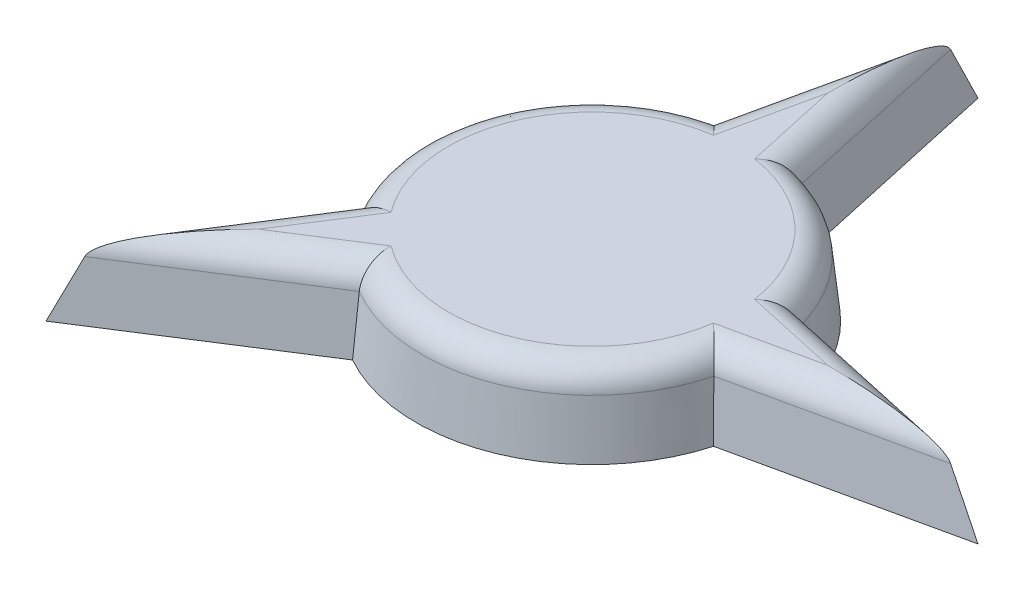
ISO-10303-21;
HEADER;
FILE_DESCRIPTION(('STEP AP214'),'2;1');
FILE_NAME('part.step','',(''),(''),'','','');
FILE_SCHEMA(('AUTOMOTIVE_DESIGN { 1 0 10303 214 1 1 1 1 }'));
ENDSEC;
DATA;
#1=APPLICATION_CONTEXT('core data for automotive mechanical design processes');
#2=APPLICATION_PROTOCOL_DEFINITION('international standard','automotive_design',2000,#1);
#3=PRODUCT_CONTEXT('',#1,'mechanical');
#4=PRODUCT('Part','Part','',(#3));
#5=PRODUCT_RELATED_PRODUCT_CATEGORY('part','',(#4));
#6=PRODUCT_DEFINITION_FORMATION('','',#4);
#7=PRODUCT_DEFINITION_CONTEXT('part definition',#1,'design');
#8=PRODUCT_DEFINITION('design','',#6,#7);
#9=PRODUCT_DEFINITION_SHAPE('','',#8);
#10=(LENGTH_UNIT() NAMED_UNIT(*) SI_UNIT(.MILLI.,.METRE.));
#11=(NAMED_UNIT(*) PLANE_ANGLE_UNIT() SI_UNIT($,.RADIAN.));
#12=(NAMED_UNIT(*) SI_UNIT($,.STERADIAN.) SOLID_ANGLE_UNIT());
#13=UNCERTAINTY_MEASURE_WITH_UNIT(LENGTH_MEASURE(1.E-05),#10,'distance_accuracy_value','');
#14=(GEOMETRIC_REPRESENTATION_CONTEXT(3) GLOBAL_UNCERTAINTY_ASSIGNED_CONTEXT((#13)) GLOBAL_UNIT_ASSIGNED_CONTEXT((#10,
#11,#12)) REPRESENTATION_CONTEXT('',''));
#15=CARTESIAN_POINT('',(0.,0.,0.));
#16=DIRECTION('',(0.,0.,1.));
#17=DIRECTION('',(1.,0.,0.));
#18=AXIS2_PLACEMENT_3D('',#15,#16,#17);
#19=CARTESIAN_POINT('',(0.,0.,0.));
#20=DIRECTION('',(0.,-1.,0.));
#21=DIRECTION('',(0.,0.,1.));
#22=AXIS2_PLACEMENT_3D('',#19,#20,#21);
#23=CONICAL_SURFACE('',#22,6.62463400876314,0.10471975511966);
#24=CARTESIAN_POINT('',(6.12143648206492,3.,1.52825086294976));
#25=CARTESIAN_POINT('',(6.16452146315479,2.50003379183349,1.57258412459455));
#26=CARTESIAN_POINT('',(6.20734635404647,2.00005068603496,1.61697636934305));
#27=CARTESIAN_POINT('',(6.29247595484941,1.0000506860345,1.70587882443751));
#28=CARTESIAN_POINT('',(6.33478066476781,0.500033791833026,1.75038903478186));
#29=CARTESIAN_POINT('',(6.37682528449516,0.,1.79495822822829));
#30=B_SPLINE_CURVE_WITH_KNOTS('',3,(#24,#25,#26,#27,#28,#29),.UNSPECIFIED.,.F.,.F.,(4,2,4),(0.,
1.51132052815368,3.02264103557015),.UNSPECIFIED.);
#31=CARTESIAN_POINT('',(6.19832923183421,2.10452846326765,1.60771506593604));
#32=VERTEX_POINT('',#31);
#33=CARTESIAN_POINT('',(6.37682528449516,0.,1.79495822822829));
#34=VERTEX_POINT('',#33);
#35=EDGE_CURVE('E137',#32,#34,#30,.T.);
#36=ORIENTED_EDGE('',*,*,#35,.F.);
#37=CARTESIAN_POINT('',(0.,2.10452846326765,0.));
#38=DIRECTION('',(0.,-1.,0.));
#39=DIRECTION('',(0.,0.,-1.));
#40=AXIS2_PLACEMENT_3D('',#37,#38,#39);
#41=CIRCLE('',#40,6.40343915403654);
#42=CARTESIAN_POINT('',(-3.24605440651769,2.10452846326765,5.51970685719589));
#43=VERTEX_POINT('',#42);
#44=EDGE_CURVE('E11',#32,#43,#41,.T.);
#45=ORIENTED_EDGE('',*,*,#44,.T.);
#46=CARTESIAN_POINT('',(-3.24787269852493,3.,5.40914579561675));
#47=CARTESIAN_POINT('',(-3.24699003087971,2.50003379183349,5.47095982785385));
#48=CARTESIAN_POINT('',(-3.24588174433904,2.00005068603496,5.53263165590068));
#49=CARTESIAN_POINT('',(-3.24321393348508,1.0000506860345,5.65569090276957));
#50=CARTESIAN_POINT('',(-3.24165440917798,0.500033791833026,5.71707832159553));
#51=CARTESIAN_POINT('',(-3.23986926598162,0.,5.77832353623513));
#52=B_SPLINE_CURVE_WITH_KNOTS('',3,(#46,#47,#48,#49,#50,#51),.UNSPECIFIED.,.F.,.F.,(4,2,4),(0.,
1.51132052815368,3.02264103557016),.UNSPECIFIED.);
#53=CARTESIAN_POINT('',(-3.23986926598162,0.,5.77832353623513));
#54=VERTEX_POINT('',#53);
#55=EDGE_CURVE('E150',#43,#54,#52,.T.);
#56=ORIENTED_EDGE('',*,*,#55,.T.);
#57=CARTESIAN_POINT('',(0.,0.,0.));
#58=DIRECTION('',(0.,1.,0.));
#59=DIRECTION('',(0.,0.,1.));
#60=AXIS2_PLACEMENT_3D('',#57,#58,#59);
#61=CIRCLE('',#60,6.62463400876314);
#62=EDGE_CURVE('E148',#54,#34,#61,.T.);
#63=ORIENTED_EDGE('',*,*,#62,.T.);
#64=EDGE_LOOP('',(#36,#45,#56,#63));
#65=FACE_BOUND('',#64,.T.);
#66=ADVANCED_FACE('F35',(#65),#23,.T.);
#67=CARTESIAN_POINT('',(0.670179790785248,0.,3.04921033416259));
#68=DIRECTION('',(0.213488310774602,0.104528463267654,0.971337501350334));
#69=DIRECTION('',(0.976687899858299,0.,-0.214664264073891));
#70=AXIS2_PLACEMENT_3D('',#67,#68,#69);
#71=PLANE('',#70);
#72=DIRECTION('',(-0.43974109158402,0.898124586219804,0.));
#73=VECTOR('',#72,1.);
#74=CARTESIAN_POINT('',(11.8608631918567,5.47919899962963,0.));
#75=LINE('',#74,#73);
#76=CARTESIAN_POINT('',(13.513174383606,2.10452846326765,0.));
#77=VERTEX_POINT('',#76);
#78=CARTESIAN_POINT('',(14.5435967302452,0.,0.));
#79=VERTEX_POINT('',#78);
#80=EDGE_CURVE('E145',#77,#79,#75,.F.);
#81=ORIENTED_EDGE('',*,*,#80,.F.);
#82=DIRECTION('',(-0.976687899858299,0.,0.214664264073891));
#83=VECTOR('',#82,1.);
#84=CARTESIAN_POINT('',(0.622697160078432,2.10452846326765,2.83317199604021));
#85=LINE('',#84,#83);
#86=EDGE_CURVE('E49',#77,#32,#85,.T.);
#87=ORIENTED_EDGE('',*,*,#86,.T.);
#88=ORIENTED_EDGE('',*,*,#35,.T.);
#89=DIRECTION('',(-0.976687899858299,0.,0.214664264073891));
#90=VECTOR('',#89,1.);
#91=CARTESIAN_POINT('',(0.670179790785248,0.,3.04921033416259));
#92=LINE('',#91,#90);
#93=EDGE_CURVE('E141',#79,#34,#92,.T.);
#94=ORIENTED_EDGE('',*,*,#93,.F.);
#95=EDGE_LOOP('',(#81,#87,#88,#94));
#96=FACE_BOUND('',#95,.T.);
#97=ADVANCED_FACE('F139',(#96),#71,.T.);
#98=CARTESIAN_POINT('',(0.670179790785269,0.,-3.04921033416259));
#99=DIRECTION('',(0.213488310774609,0.104528463267654,-0.971337501350332));
#100=DIRECTION('',(-0.976687899858298,0.,-0.214664264073898));
#101=AXIS2_PLACEMENT_3D('',#98,#99,#100);
#102=PLANE('',#101);
#103=CARTESIAN_POINT('',(6.12143648206493,3.,-1.52825086294971));
#104=CARTESIAN_POINT('',(6.1645214631548,2.50003379183349,-1.57258412459451));
#105=CARTESIAN_POINT('',(6.20734635404648,2.00005068603496,-1.61697636934301));
#106=CARTESIAN_POINT('',(6.29247595484942,1.0000506860345,-1.70587882443747));
#107=CARTESIAN_POINT('',(6.33478066476782,0.500033791833026,-1.75038903478182));
#108=CARTESIAN_POINT('',(6.37682528449517,0.,-1.79495822822824));
#109=B_SPLINE_CURVE_WITH_KNOTS('',3,(#103,#104,#105,#106,#107,#108),.UNSPECIFIED.,.F.,.F.,(4,2,
4),(0.,1.51132052815368,3.02264103557015),.UNSPECIFIED.);
#110=CARTESIAN_POINT('',(6.19832923183422,2.10452846326765,-1.607715065936));
#111=VERTEX_POINT('',#110);
#112=CARTESIAN_POINT('',(6.37682528449517,0.,-1.79495822822824));
#113=VERTEX_POINT('',#112);
#114=EDGE_CURVE('E237',#111,#113,#109,.T.);
#115=ORIENTED_EDGE('',*,*,#114,.F.);
#116=DIRECTION('',(-0.976687899858298,0.,-0.214664264073898));
#117=VECTOR('',#116,1.);
#118=CARTESIAN_POINT('',(13.0949360212821,2.10452846326765,-0.0919237663011116));
#119=LINE('',#118,#117);
#120=EDGE_CURVE('E64',#111,#77,#119,.F.);
#121=ORIENTED_EDGE('',*,*,#120,.T.);
#122=ORIENTED_EDGE('',*,*,#80,.T.);
#123=DIRECTION('',(-0.976687899858298,0.,-0.214664264073898));
#124=VECTOR('',#123,1.);
#125=CARTESIAN_POINT('',(0.670179790785269,0.,-3.04921033416259));
#126=LINE('',#125,#124);
#127=EDGE_CURVE('E161',#79,#113,#126,.T.);
#128=ORIENTED_EDGE('',*,*,#127,.T.);
#129=EDGE_LOOP('',(#115,#121,#122,#128));
#130=FACE_BOUND('',#129,.T.);
#131=ADVANCED_FACE('F243',(#130),#102,.T.);
#132=CARTESIAN_POINT('',(0.,0.,0.));
#133=DIRECTION('',(0.,-1.,0.));
#134=DIRECTION('',(0.,0.,1.));
#135=AXIS2_PLACEMENT_3D('',#132,#133,#134);
#136=CONICAL_SURFACE('',#135,6.62463400876314,0.10471975511966);
#137=CARTESIAN_POINT('',(1.52825086294973,3.,-6.12143648206492));
#138=CARTESIAN_POINT('',(1.57258412459453,2.50003379183349,-6.16452146315479));
#139=CARTESIAN_POINT('',(1.61697636934303,2.00005068603496,-6.20734635404647));
#140=CARTESIAN_POINT('',(1.70587882443749,1.0000506860345,-6.29247595484942));
#141=CARTESIAN_POINT('',(1.75038903478184,0.500033791833026,-6.33478066476782));
#142=CARTESIAN_POINT('',(1.79495822822827,0.,-6.37682528449516));
#143=B_SPLINE_CURVE_WITH_KNOTS('',3,(#137,#138,#139,#140,#141,#142),.UNSPECIFIED.,.F.,.F.,(4,2,
4),(0.,1.51132052815368,3.02264103557015),.UNSPECIFIED.);
#144=CARTESIAN_POINT('',(1.60771506593602,2.10452846326765,-6.19832923183422));
#145=VERTEX_POINT('',#144);
#146=CARTESIAN_POINT('',(1.79495822822827,0.,-6.37682528449516));
#147=VERTEX_POINT('',#146);
#148=EDGE_CURVE('E232',#145,#147,#143,.T.);
#149=ORIENTED_EDGE('',*,*,#148,.F.);
#150=CARTESIAN_POINT('',(0.,2.10452846326765,0.));
#151=DIRECTION('',(0.,-1.,0.));
#152=DIRECTION('',(0.,0.,-1.));
#153=AXIS2_PLACEMENT_3D('',#150,#151,#152);
#154=CIRCLE('',#153,6.40343915403654);
#155=EDGE_CURVE('E326',#145,#111,#154,.T.);
#156=ORIENTED_EDGE('',*,*,#155,.T.);
#157=ORIENTED_EDGE('',*,*,#114,.T.);
#158=EDGE_CURVE('E156',#113,#147,#61,.T.);
#159=ORIENTED_EDGE('',*,*,#158,.T.);
#160=EDGE_LOOP('',(#149,#156,#157,#159));
#161=FACE_BOUND('',#160,.T.);
#162=ADVANCED_FACE('F228',(#161),#136,.T.);
#163=CARTESIAN_POINT('',(3.04921033416259,0.,-0.670179790785258));
#164=DIRECTION('',(0.971337501350333,0.104528463267654,-0.213488310774605));
#165=DIRECTION('',(-0.214664264073895,0.,-0.976687899858298));
#166=AXIS2_PLACEMENT_3D('',#163,#164,#165);
#167=PLANE('',#166);
#168=DIRECTION('',(0.,0.898124586219804,0.43974109158402));
#169=VECTOR('',#168,1.);
#170=CARTESIAN_POINT('',(0.,5.47919899962963,-11.8608631918567));
#171=LINE('',#170,#169);
#172=CARTESIAN_POINT('',(0.,2.10452846326765,-13.513174383606));
#173=VERTEX_POINT('',#172);
#174=CARTESIAN_POINT('',(0.,0.,-14.5435967302452));
#175=VERTEX_POINT('',#174);
#176=EDGE_CURVE('E217',#173,#175,#171,.F.);
#177=ORIENTED_EDGE('',*,*,#176,.F.);
#178=DIRECTION('',(0.214664264073895,0.,0.976687899858298));
#179=VECTOR('',#178,1.);
#180=CARTESIAN_POINT('',(2.83317199604021,2.10452846326765,-0.622697160078441));
#181=LINE('',#180,#179);
#182=EDGE_CURVE('E356',#173,#145,#181,.T.);
#183=ORIENTED_EDGE('',*,*,#182,.T.);
#184=ORIENTED_EDGE('',*,*,#148,.T.);
#185=DIRECTION('',(0.214664264073895,0.,0.976687899858298));
#186=VECTOR('',#185,1.);
#187=CARTESIAN_POINT('',(3.04921033416259,0.,-0.670179790785258));
#188=LINE('',#187,#186);
#189=EDGE_CURVE('E165',#175,#147,#188,.T.);
#190=ORIENTED_EDGE('',*,*,#189,.F.);
#191=EDGE_LOOP('',(#177,#183,#184,#190));
#192=FACE_BOUND('',#191,.T.);
#193=ADVANCED_FACE('F223',(#192),#167,.T.);
#194=CARTESIAN_POINT('',(-3.04921033416259,0.,-0.670179790785258));
#195=DIRECTION('',(-0.971337501350333,0.104528463267654,-0.213488310774605));
#196=DIRECTION('',(-0.214664264073895,0.,0.976687899858298));
#197=AXIS2_PLACEMENT_3D('',#194,#195,#196);
#198=PLANE('',#197);
#199=CARTESIAN_POINT('',(-1.52825086294973,3.,-6.12143648206492));
#200=CARTESIAN_POINT('',(-1.57258412459453,2.50003379183349,-6.16452146315479));
#201=CARTESIAN_POINT('',(-1.61697636934303,2.00005068603496,-6.20734635404647));
#202=CARTESIAN_POINT('',(-1.70587882443749,1.0000506860345,-6.29247595484942));
#203=CARTESIAN_POINT('',(-1.75038903478184,0.500033791833026,-6.33478066476782));
#204=CARTESIAN_POINT('',(-1.79495822822827,0.,-6.37682528449516));
#205=B_SPLINE_CURVE_WITH_KNOTS('',3,(#199,#200,#201,#202,#203,#204),.UNSPECIFIED.,.F.,.F.,(4,2,
4),(0.,1.51132052815368,3.02264103557015),.UNSPECIFIED.);
#206=CARTESIAN_POINT('',(-1.60771506593602,2.10452846326765,-6.19832923183422));
#207=VERTEX_POINT('',#206);
#208=CARTESIAN_POINT('',(-1.79495822822827,0.,-6.37682528449516));
#209=VERTEX_POINT('',#208);
#210=EDGE_CURVE('E211',#207,#209,#205,.T.);
#211=ORIENTED_EDGE('',*,*,#210,.F.);
#212=DIRECTION('',(-0.214664264073895,0.,0.976687899858298));
#213=VECTOR('',#212,1.);
#214=CARTESIAN_POINT('',(-0.0919237663011577,2.10452846326765,-13.0949360212821));
#215=LINE('',#214,#213);
#216=EDGE_CURVE('E354',#207,#173,#215,.F.);
#217=ORIENTED_EDGE('',*,*,#216,.T.);
#218=ORIENTED_EDGE('',*,*,#176,.T.);
#219=DIRECTION('',(-0.214664264073895,0.,0.976687899858298));
#220=VECTOR('',#219,1.);
#221=CARTESIAN_POINT('',(-3.04921033416259,0.,-0.670179790785258));
#222=LINE('',#221,#220);
#223=EDGE_CURVE('E168',#175,#209,#222,.T.);
#224=ORIENTED_EDGE('',*,*,#223,.T.);
#225=EDGE_LOOP('',(#211,#217,#218,#224));
#226=FACE_BOUND('',#225,.T.);
#227=ADVANCED_FACE('F219',(#226),#198,.T.);
#228=CARTESIAN_POINT('',(0.,0.,0.));
#229=DIRECTION('',(0.,-1.,0.));
#230=DIRECTION('',(0.,0.,1.));
#231=AXIS2_PLACEMENT_3D('',#228,#229,#230);
#232=CONICAL_SURFACE('',#231,6.62463400876314,0.10471975511966);
#233=CARTESIAN_POINT('',(-5.40914579561681,3.,3.24787269852483));
#234=CARTESIAN_POINT('',(-5.47095982785391,2.50003379183349,3.24699003087961));
#235=CARTESIAN_POINT('',(-5.53263165590074,2.00005068603496,3.24588174433894));
#236=CARTESIAN_POINT('',(-5.65569090276963,1.0000506860345,3.24321393348498));
#237=CARTESIAN_POINT('',(-5.71707832159559,0.500033791833026,3.24165440917788));
#238=CARTESIAN_POINT('',(-5.77832353623519,0.,3.23986926598152));
#239=B_SPLINE_CURVE_WITH_KNOTS('',3,(#233,#234,#235,#236,#237,#238),.UNSPECIFIED.,.F.,.F.,(4,2,
4),(0.,1.51132052815368,3.02264103557015),.UNSPECIFIED.);
#240=CARTESIAN_POINT('',(-5.51970685719595,2.10452846326765,3.24605440651759));
#241=VERTEX_POINT('',#240);
#242=CARTESIAN_POINT('',(-5.77832353623519,0.,3.23986926598152));
#243=VERTEX_POINT('',#242);
#244=EDGE_CURVE('E206',#241,#243,#239,.T.);
#245=ORIENTED_EDGE('',*,*,#244,.F.);
#246=CARTESIAN_POINT('',(0.,2.10452846326765,0.));
#247=DIRECTION('',(0.,-1.,0.));
#248=DIRECTION('',(0.,0.,-1.));
#249=AXIS2_PLACEMENT_3D('',#246,#247,#248);
#250=CIRCLE('',#249,6.40343915403654);
#251=EDGE_CURVE('E352',#241,#207,#250,.T.);
#252=ORIENTED_EDGE('',*,*,#251,.T.);
#253=ORIENTED_EDGE('',*,*,#210,.T.);
#254=EDGE_CURVE('E155',#209,#243,#61,.T.);
#255=ORIENTED_EDGE('',*,*,#254,.T.);
#256=EDGE_LOOP('',(#245,#252,#253,#255));
#257=FACE_BOUND('',#256,.T.);
#258=ADVANCED_FACE('F201',(#257),#232,.T.);
#259=CARTESIAN_POINT('',(-2.63000597922889,0.,-1.68222862987205));
#260=DIRECTION('',(-0.837798366278398,0.104528463267654,-0.53588030177284));
#261=DIRECTION('',(-0.538832080287587,0.,0.842413193897717));
#262=AXIS2_PLACEMENT_3D('',#259,#260,#261);
#263=PLANE('',#262);
#264=DIRECTION('',(0.310943907825438,0.898124586219804,-0.310943907825433));
#265=VECTOR('',#264,1.);
#266=CARTESIAN_POINT('',(-8.38689679368786,5.47919899962963,8.38689679368771));
#267=LINE('',#266,#265);
#268=CARTESIAN_POINT('',(-9.55525724200427,2.10452846326765,9.5552572420041));
#269=VERTEX_POINT('',#268);
#270=CARTESIAN_POINT('',(-10.283875870799,0.,10.2838758707988));
#271=VERTEX_POINT('',#270);
#272=EDGE_CURVE('E212',#269,#271,#267,.F.);
#273=ORIENTED_EDGE('',*,*,#272,.F.);
#274=DIRECTION('',(0.538832080287587,0.,-0.842413193897717));
#275=VECTOR('',#274,1.);
#276=CARTESIAN_POINT('',(-2.44366851518492,2.10452846326765,-1.56304174615081));
#277=LINE('',#276,#275);
#278=EDGE_CURVE('E350',#269,#241,#277,.T.);
#279=ORIENTED_EDGE('',*,*,#278,.T.);
#280=ORIENTED_EDGE('',*,*,#244,.T.);
#281=DIRECTION('',(0.538832080287587,0.,-0.842413193897717));
#282=VECTOR('',#281,1.);
#283=CARTESIAN_POINT('',(-2.63000597922889,0.,-1.68222862987205));
#284=LINE('',#283,#282);
#285=EDGE_CURVE('E171',#271,#243,#284,.T.);
#286=ORIENTED_EDGE('',*,*,#285,.F.);
#287=EDGE_LOOP('',(#273,#279,#280,#286));
#288=FACE_BOUND('',#287,.T.);
#289=ADVANCED_FACE('F196',(#288),#263,.T.);
#290=CARTESIAN_POINT('',(1.68222862987201,0.,2.63000597922892));
#291=DIRECTION('',(0.535880301772826,0.104528463267654,0.837798366278407));
#292=DIRECTION('',(0.842413193897726,0.,-0.538832080287572));
#293=AXIS2_PLACEMENT_3D('',#290,#291,#292);
#294=PLANE('',#293);
#295=ORIENTED_EDGE('',*,*,#55,.F.);
#296=DIRECTION('',(0.842413193897726,0.,-0.538832080287572));
#297=VECTOR('',#296,1.);
#298=CARTESIAN_POINT('',(-9.19451814134889,2.10452846326765,9.32451797835624));
#299=LINE('',#298,#297);
#300=EDGE_CURVE('E347',#43,#269,#299,.F.);
#301=ORIENTED_EDGE('',*,*,#300,.T.);
#302=ORIENTED_EDGE('',*,*,#272,.T.);
#303=DIRECTION('',(0.842413193897726,0.,-0.538832080287572));
#304=VECTOR('',#303,1.);
#305=CARTESIAN_POINT('',(1.68222862987201,0.,2.63000597922892));
#306=LINE('',#305,#304);
#307=EDGE_CURVE('E174',#271,#54,#306,.T.);
#308=ORIENTED_EDGE('',*,*,#307,.T.);
#309=EDGE_LOOP('',(#295,#301,#302,#308));
#310=FACE_BOUND('',#309,.T.);
#311=ADVANCED_FACE('F190',(#310),#294,.T.);
#312=CARTESIAN_POINT('',(0.,3.,0.));
#313=DIRECTION('',(0.,1.,0.));
#314=DIRECTION('',(0.,0.,1.));
#315=AXIS2_PLACEMENT_3D('',#312,#313,#314);
#316=PLANE('',#315);
#317=DIRECTION('',(0.538832080287587,0.,-0.842413193897717));
#318=VECTOR('',#317,1.);
#319=CARTESIAN_POINT('',(-1.60587014890652,3.,-1.02716144437797));
#320=LINE('',#319,#318);
#321=CARTESIAN_POINT('',(-4.33336694396194,3.,3.23702283589372));
#322=VERTEX_POINT('',#321);
#323=CARTESIAN_POINT('',(-6.27928963143201,3.,6.2792896314319));
#324=VERTEX_POINT('',#323);
#325=EDGE_CURVE('E342',#322,#324,#320,.F.);
#326=ORIENTED_EDGE('',*,*,#325,.T.);
#327=DIRECTION('',(-0.842413193897726,0.,0.538832080287572));
#328=VECTOR('',#327,1.);
#329=CARTESIAN_POINT('',(-3.73303928281327,3.,4.65063354886138));
#330=LINE('',#329,#328);
#331=CARTESIAN_POINT('',(-3.2370228358938,3.,4.33336694396188));
#332=VERTEX_POINT('',#331);
#333=EDGE_CURVE('E344',#324,#332,#330,.F.);
#334=ORIENTED_EDGE('',*,*,#333,.T.);
#335=CARTESIAN_POINT('',(0.,3.,0.));
#336=DIRECTION('',(0.,1.,0.));
#337=DIRECTION('',(0.,0.,1.));
#338=AXIS2_PLACEMENT_3D('',#335,#336,#337);
#339=CIRCLE('',#338,5.40891725866827);
#340=CARTESIAN_POINT('',(5.35307394956128,3.,0.775232353328926));
#341=VERTEX_POINT('',#340);
#342=EDGE_CURVE('E144',#332,#341,#339,.T.);
#343=ORIENTED_EDGE('',*,*,#342,.T.);
#344=DIRECTION('',(-0.976687899858299,0.,0.214664264073891));
#345=VECTOR('',#344,1.);
#346=CARTESIAN_POINT('',(0.40920884930383,3.,1.86183449468988));
#347=LINE('',#346,#345);
#348=CARTESIAN_POINT('',(8.88025655883981,3.,0.));
#349=VERTEX_POINT('',#348);
#350=EDGE_CURVE('E335',#341,#349,#347,.F.);
#351=ORIENTED_EDGE('',*,*,#350,.T.);
#352=DIRECTION('',(0.976687899858298,0.,0.214664264073898));
#353=VECTOR('',#352,1.);
#354=CARTESIAN_POINT('',(5.92815191052657,3.,-0.648837127900538));
#355=LINE('',#354,#353);
#356=CARTESIAN_POINT('',(5.35307394956128,3.,-0.775232353328889));
#357=VERTEX_POINT('',#356);
#358=EDGE_CURVE('E320',#349,#357,#355,.F.);
#359=ORIENTED_EDGE('',*,*,#358,.T.);
#360=CARTESIAN_POINT('',(0.,3.,0.));
#361=DIRECTION('',(0.,1.,0.));
#362=DIRECTION('',(0.,0.,1.));
#363=AXIS2_PLACEMENT_3D('',#360,#361,#362);
#364=CIRCLE('',#363,5.40891725866827);
#365=CARTESIAN_POINT('',(0.775232353328907,3.,-5.35307394956128));
#366=VERTEX_POINT('',#365);
#367=EDGE_CURVE('E327',#357,#366,#364,.T.);
#368=ORIENTED_EDGE('',*,*,#367,.T.);
#369=DIRECTION('',(0.214664264073895,0.,0.976687899858298));
#370=VECTOR('',#369,1.);
#371=CARTESIAN_POINT('',(1.86183449468988,3.,-0.409208849303836));
#372=LINE('',#371,#370);
#373=CARTESIAN_POINT('',(0.,3.,-8.88025655883981));
#374=VERTEX_POINT('',#373);
#375=EDGE_CURVE('E331',#366,#374,#372,.F.);
#376=ORIENTED_EDGE('',*,*,#375,.T.);
#377=DIRECTION('',(0.214664264073895,0.,-0.976687899858298));
#378=VECTOR('',#377,1.);
#379=CARTESIAN_POINT('',(-0.648837127900559,3.,-5.92815191052657));
#380=LINE('',#379,#378);
#381=CARTESIAN_POINT('',(-0.775232353328907,3.,-5.35307394956128));
#382=VERTEX_POINT('',#381);
#383=EDGE_CURVE('E333',#374,#382,#380,.F.);
#384=ORIENTED_EDGE('',*,*,#383,.T.);
#385=CARTESIAN_POINT('',(0.,3.,0.));
#386=DIRECTION('',(0.,1.,0.));
#387=DIRECTION('',(0.,0.,1.));
#388=AXIS2_PLACEMENT_3D('',#385,#386,#387);
#389=CIRCLE('',#388,5.40891725866827);
#390=EDGE_CURVE('E340',#382,#322,#389,.T.);
#391=ORIENTED_EDGE('',*,*,#390,.T.);
#392=EDGE_LOOP('',(#326,#334,#343,#351,#359,#368,#376,#384,#391));
#393=FACE_BOUND('',#392,.T.);
#394=ADVANCED_FACE('F195',(#393),#316,.T.);
#395=CARTESIAN_POINT('',(0.,0.,0.));
#396=DIRECTION('',(0.,1.,0.));
#397=DIRECTION('',(0.,0.,1.));
#398=AXIS2_PLACEMENT_3D('',#395,#396,#397);
#399=PLANE('',#398);
#400=ORIENTED_EDGE('',*,*,#62,.F.);
#401=ORIENTED_EDGE('',*,*,#307,.F.);
#402=ORIENTED_EDGE('',*,*,#285,.T.);
#403=ORIENTED_EDGE('',*,*,#254,.F.);
#404=ORIENTED_EDGE('',*,*,#223,.F.);
#405=ORIENTED_EDGE('',*,*,#189,.T.);
#406=ORIENTED_EDGE('',*,*,#158,.F.);
#407=ORIENTED_EDGE('',*,*,#127,.F.);
#408=ORIENTED_EDGE('',*,*,#93,.T.);
#409=EDGE_LOOP('',(#400,#401,#402,#403,#404,#405,#406,#407,#408));
#410=FACE_BOUND('',#409,.T.);
#411=ADVANCED_FACE('F158',(#410),#399,.F.);
#412=CARTESIAN_POINT('',(1.86183449468988,2.,-0.409208849303836));
#413=DIRECTION('',(0.214664264073895,0.,0.976687899858298));
#414=DIRECTION('',(0.976687899858298,0.,-0.214664264073895));
#415=AXIS2_PLACEMENT_3D('',#412,#413,#414);
#416=CYLINDRICAL_SURFACE('',#415,1.);
#417=CARTESIAN_POINT('',(0.,2.,-8.88025655883981));
#418=DIRECTION('',(1.,0.,0.));
#419=DIRECTION('',(0.,0.,1.));
#420=AXIS2_PLACEMENT_3D('',#417,#418,#419);
#421=ELLIPSE('',#420,4.65843723133985,1.);
#422=EDGE_CURVE('E307',#374,#173,#421,.F.);
#423=ORIENTED_EDGE('',*,*,#422,.F.);
#424=ORIENTED_EDGE('',*,*,#375,.F.);
#425=CARTESIAN_POINT('',(1.60771506593602,2.10452846326765,-6.19832923183422));
#426=CARTESIAN_POINT('',(1.60543903125857,2.13017395544137,-6.19613649361711));
#427=CARTESIAN_POINT('',(1.60232609405751,2.15566076925377,-6.19313750575092));
#428=CARTESIAN_POINT('',(1.59448232815594,2.2061355742757,-6.18557418743605));
#429=CARTESIAN_POINT('',(1.58975231748793,2.23112381095022,-6.18101064844699));
#430=CARTESIAN_POINT('',(1.57328096237755,2.30481550702428,-6.1651023184457));
#431=CARTESIAN_POINT('',(1.55922996867439,2.35255334724184,-6.15151268265279));
#432=CARTESIAN_POINT('',(1.5257263736901,2.44399657939179,-6.11899776316723));
#433=CARTESIAN_POINT('',(1.5062825808769,2.48770839354772,-6.10008117961713));
#434=CARTESIAN_POINT('',(1.46283110677104,2.57040162048487,-6.05762538001375));
#435=CARTESIAN_POINT('',(1.43881843291895,2.60937778140728,-6.03408110620022));
#436=CARTESIAN_POINT('',(1.38526424699855,2.68463433744053,-5.98130370145649));
#437=CARTESIAN_POINT('',(1.35544833579956,2.72051533703873,-5.95178213301643));
#438=CARTESIAN_POINT('',(1.29264627712428,2.78582419284886,-5.88921020547243));
#439=CARTESIAN_POINT('',(1.25965881884639,2.81524936423187,-5.8561583866832));
#440=CARTESIAN_POINT('',(1.18622947501187,2.87152696587277,-5.78207482970662));
#441=CARTESIAN_POINT('',(1.14541765101697,2.89730407713894,-5.74059457117611));
#442=CARTESIAN_POINT('',(1.06200091726666,2.94020758421309,-5.65506493305952));
#443=CARTESIAN_POINT('',(1.01939564413391,2.95733221768225,-5.6110150321244));
#444=CARTESIAN_POINT('',(0.94380593166615,2.97999387963477,-5.53212766126565));
#445=CARTESIAN_POINT('',(0.910982550442739,2.98733046284243,-5.49763409774724));
#446=CARTESIAN_POINT('',(0.845284712916627,2.99721667357886,-5.42808245204516));
#447=CARTESIAN_POINT('',(0.812410393707199,2.99977303019609,-5.39302523358569));
#448=CARTESIAN_POINT('',(0.778200758540832,2.99999518630591,-5.35626530187535));
#449=CARTESIAN_POINT('',(0.776716392985473,3.00000000344737,-5.35466972693549));
#450=CARTESIAN_POINT('',(0.775232353328907,3.,-5.35307394956128));
#451=B_SPLINE_CURVE_WITH_KNOTS('',3,(#425,#426,#427,#428,#429,#430,#431,#432,#433,#434,#435,
#436,#437,#438,#439,#440,#441,#442,#443,#444,#445,#446,#447,#448,#449,#450),.UNSPECIFIED.,.F.,
.F.,(4,2,2,2,2,2,2,2,2,2,2,2,4),(0.,0.0774632524831683,0.154887376303542,0.308819029238617,
0.462500719791221,0.616351317746332,0.781339193288913,0.946395553937745,1.13660380487697,
1.32685078187831,1.47115912056896,1.61526416414079,1.6218019520904),.UNSPECIFIED.);
#452=EDGE_CURVE('E40',#145,#366,#451,.T.);
#453=ORIENTED_EDGE('',*,*,#452,.F.);
#454=ORIENTED_EDGE('',*,*,#182,.F.);
#455=EDGE_LOOP('',(#423,#424,#453,#454));
#456=FACE_BOUND('',#455,.T.);
#457=ADVANCED_FACE('F37',(#456),#416,.T.);
#458=CARTESIAN_POINT('',(0.,2.,0.));
#459=DIRECTION('',(0.,1.,0.));
#460=DIRECTION('',(0.,0.,1.));
#461=AXIS2_PLACEMENT_3D('',#458,#459,#460);
#462=TOROIDAL_SURFACE('',#461,5.40891725866827,1.);
#463=ORIENTED_EDGE('',*,*,#452,.T.);
#464=ORIENTED_EDGE('',*,*,#367,.F.);
#465=CARTESIAN_POINT('',(6.19832923183422,2.10452846326765,-1.607715065936));
#466=CARTESIAN_POINT('',(6.19613649361711,2.13017395544137,-1.60543903125855));
#467=CARTESIAN_POINT('',(6.19313750575092,2.15566076925377,-1.60232609405749));
#468=CARTESIAN_POINT('',(6.18557418743606,2.2061355742757,-1.59448232815592));
#469=CARTESIAN_POINT('',(6.181010648447,2.23112381095022,-1.58975231748791));
#470=CARTESIAN_POINT('',(6.16510231844571,2.30481550702428,-1.57328096237753));
#471=CARTESIAN_POINT('',(6.1515126826528,2.35255334724184,-1.55922996867437));
#472=CARTESIAN_POINT('',(6.11899776316724,2.44399657939179,-1.52572637369008));
#473=CARTESIAN_POINT('',(6.10008117961714,2.48770839354772,-1.50628258087688));
#474=CARTESIAN_POINT('',(6.05762538001376,2.57040162048487,-1.46283110677102));
#475=CARTESIAN_POINT('',(6.03408110620023,2.60937778140728,-1.43881843291893));
#476=CARTESIAN_POINT('',(5.9813037014565,2.68463433744053,-1.38526424699853));
#477=CARTESIAN_POINT('',(5.95178213301644,2.72051533703873,-1.35544833579954));
#478=CARTESIAN_POINT('',(5.88921020547244,2.78582419284886,-1.29264627712426));
#479=CARTESIAN_POINT('',(5.8561583866832,2.81524936423187,-1.25965881884637));
#480=CARTESIAN_POINT('',(5.78207482970662,2.87152696587277,-1.18622947501185));
#481=CARTESIAN_POINT('',(5.74059457117612,2.89730407713894,-1.14541765101695));
#482=CARTESIAN_POINT('',(5.65506493305953,2.94020758421309,-1.06200091726664));
#483=CARTESIAN_POINT('',(5.61101503212441,2.95733221768225,-1.01939564413389));
#484=CARTESIAN_POINT('',(5.53212766126565,2.97999387963477,-0.943805931666132));
#485=CARTESIAN_POINT('',(5.49763409774724,2.98733046284243,-0.910982550442725));
#486=CARTESIAN_POINT('',(5.42808245204517,2.99721667357886,-0.845284712916601));
#487=CARTESIAN_POINT('',(5.39302523358572,2.99977303019609,-0.812410393707159));
#488=CARTESIAN_POINT('',(5.35626530187536,2.99999518630591,-0.778200758540812));
#489=CARTESIAN_POINT('',(5.35466972693549,3.00000000344737,-0.776716392985454));
#490=CARTESIAN_POINT('',(5.35307394956128,3.,-0.775232353328888));
#491=B_SPLINE_CURVE_WITH_KNOTS('',3,(#465,#466,#467,#468,#469,#470,#471,#472,#473,#474,#475,
#476,#477,#478,#479,#480,#481,#482,#483,#484,#485,#486,#487,#488,#489,#490),.UNSPECIFIED.,.F.,
.F.,(4,2,2,2,2,2,2,2,2,2,2,2,4),(0.,0.0774632524831688,0.154887376303542,0.308819029238617,
0.462500719791221,0.616351317746332,0.781339193288913,0.946395553937745,1.13660380487697,
1.32685078187831,1.47115912056896,1.61526416414079,1.6218019520904),.UNSPECIFIED.);
#492=EDGE_CURVE('E301',#111,#357,#491,.T.);
#493=ORIENTED_EDGE('',*,*,#492,.F.);
#494=ORIENTED_EDGE('',*,*,#155,.F.);
#495=EDGE_LOOP('',(#463,#464,#493,#494));
#496=FACE_BOUND('',#495,.T.);
#497=ADVANCED_FACE('F308',(#496),#462,.T.);
#498=CARTESIAN_POINT('',(-1.86183449468988,2.,-0.409208849303836));
#499=DIRECTION('',(-0.214664264073895,0.,0.976687899858298));
#500=DIRECTION('',(0.976687899858298,0.,0.214664264073895));
#501=AXIS2_PLACEMENT_3D('',#498,#499,#500);
#502=CYLINDRICAL_SURFACE('',#501,1.);
#503=ORIENTED_EDGE('',*,*,#422,.T.);
#504=ORIENTED_EDGE('',*,*,#216,.F.);
#505=CARTESIAN_POINT('',(-1.60771506593602,2.10452846326765,-6.19832923183422));
#506=CARTESIAN_POINT('',(-1.60543903125857,2.13017395544137,-6.1961364936171));
#507=CARTESIAN_POINT('',(-1.60232609405751,2.15566076925377,-6.19313750575092));
#508=CARTESIAN_POINT('',(-1.59448232815594,2.2061355742757,-6.18557418743605));
#509=CARTESIAN_POINT('',(-1.58975231748793,2.23112381095022,-6.18101064844699));
#510=CARTESIAN_POINT('',(-1.57328096237755,2.30481550702428,-6.1651023184457));
#511=CARTESIAN_POINT('',(-1.55922996867439,2.35255334724184,-6.15151268265279));
#512=CARTESIAN_POINT('',(-1.5257263736901,2.44399657939179,-6.11899776316723));
#513=CARTESIAN_POINT('',(-1.5062825808769,2.48770839354772,-6.10008117961713));
#514=CARTESIAN_POINT('',(-1.46283110677104,2.57040162048487,-6.05762538001375));
#515=CARTESIAN_POINT('',(-1.43881843291895,2.60937778140728,-6.03408110620022));
#516=CARTESIAN_POINT('',(-1.38526424699855,2.68463433744053,-5.98130370145649));
#517=CARTESIAN_POINT('',(-1.35544833579956,2.72051533703873,-5.95178213301643));
#518=CARTESIAN_POINT('',(-1.29264627712428,2.78582419284886,-5.88921020547244));
#519=CARTESIAN_POINT('',(-1.25965881884639,2.81524936423187,-5.8561583866832));
#520=CARTESIAN_POINT('',(-1.18622947501187,2.87152696587277,-5.78207482970662));
#521=CARTESIAN_POINT('',(-1.14541765101697,2.89730407713894,-5.74059457117611));
#522=CARTESIAN_POINT('',(-1.06200091726666,2.94020758421309,-5.65506493305952));
#523=CARTESIAN_POINT('',(-1.01939564413391,2.95733221768225,-5.6110150321244));
#524=CARTESIAN_POINT('',(-0.94380593166615,2.97999387963477,-5.53212766126565));
#525=CARTESIAN_POINT('',(-0.910982550442737,2.98733046284243,-5.49763409774724));
#526=CARTESIAN_POINT('',(-0.845284712916628,2.99721667357886,-5.42808245204516));
#527=CARTESIAN_POINT('',(-0.812410393707206,2.99977303019609,-5.39302523358569));
#528=CARTESIAN_POINT('',(-0.778200758540832,2.99999518630591,-5.35626530187535));
#529=CARTESIAN_POINT('',(-0.776716392985473,3.00000000344737,-5.35466972693549));
#530=CARTESIAN_POINT('',(-0.775232353328907,3.,-5.35307394956128));
#531=B_SPLINE_CURVE_WITH_KNOTS('',3,(#505,#506,#507,#508,#509,#510,#511,#512,#513,#514,#515,
#516,#517,#518,#519,#520,#521,#522,#523,#524,#525,#526,#527,#528,#529,#530),.UNSPECIFIED.,.F.,
.F.,(4,2,2,2,2,2,2,2,2,2,2,2,4),(0.,0.0774632524831682,0.154887376303542,0.308819029238617,
0.462500719791221,0.616351317746332,0.781339193288912,0.946395553937745,1.13660380487697,
1.32685078187831,1.47115912056896,1.61526416414079,1.6218019520904),.UNSPECIFIED.);
#532=EDGE_CURVE('E295',#382,#207,#531,.F.);
#533=ORIENTED_EDGE('',*,*,#532,.F.);
#534=ORIENTED_EDGE('',*,*,#383,.F.);
#535=EDGE_LOOP('',(#503,#504,#533,#534));
#536=FACE_BOUND('',#535,.T.);
#537=ADVANCED_FACE('F291',(#536),#502,.T.);
#538=CARTESIAN_POINT('',(0.409208849303842,2.,-1.86183449468988));
#539=DIRECTION('',(-0.976687899858298,0.,-0.214664264073898));
#540=DIRECTION('',(-0.214664264073898,0.,0.976687899858298));
#541=AXIS2_PLACEMENT_3D('',#538,#539,#540);
#542=CYLINDRICAL_SURFACE('',#541,1.);
#543=ORIENTED_EDGE('',*,*,#492,.T.);
#544=ORIENTED_EDGE('',*,*,#358,.F.);
#545=CARTESIAN_POINT('',(8.88025655883981,2.,0.));
#546=DIRECTION('',(0.,0.,1.));
#547=DIRECTION('',(-1.,0.,0.));
#548=AXIS2_PLACEMENT_3D('',#545,#546,#547);
#549=ELLIPSE('',#548,4.65843723133985,1.);
#550=EDGE_CURVE('E302',#77,#349,#549,.T.);
#551=ORIENTED_EDGE('',*,*,#550,.F.);
#552=ORIENTED_EDGE('',*,*,#120,.F.);
#553=EDGE_LOOP('',(#543,#544,#551,#552));
#554=FACE_BOUND('',#553,.T.);
#555=ADVANCED_FACE('F289',(#554),#542,.T.);
#556=CARTESIAN_POINT('',(0.,2.,0.));
#557=DIRECTION('',(0.,1.,0.));
#558=DIRECTION('',(0.,0.,1.));
#559=AXIS2_PLACEMENT_3D('',#556,#557,#558);
#560=TOROIDAL_SURFACE('',#559,5.40891725866827,1.);
#561=ORIENTED_EDGE('',*,*,#532,.T.);
#562=ORIENTED_EDGE('',*,*,#251,.F.);
#563=CARTESIAN_POINT('',(-5.51970685719595,2.10452846326765,3.24605440651759));
#564=CARTESIAN_POINT('',(-5.51654695757862,2.13017395544137,3.24611330600954));
#565=CARTESIAN_POINT('',(-5.51222517391747,2.15566076925377,3.24619388035694));
#566=CARTESIAN_POINT('',(-5.50133072018971,2.2061355742757,3.24639218674727));
#567=CARTESIAN_POINT('',(-5.4947591882059,2.23112381095022,3.24650990000033));
#568=CARTESIAN_POINT('',(-5.47186329329076,2.30481550702428,3.24690801887295));
#569=CARTESIAN_POINT('',(-5.45231841673782,2.35255334724184,3.24723424817984));
#570=CARTESIAN_POINT('',(-5.40563627747232,2.44399657939179,3.24793334732938));
#571=CARTESIAN_POINT('',(-5.37851139521697,2.48770839354772,3.24830614057443));
#572=CARTESIAN_POINT('',(-5.31776577942391,2.57040162048487,3.24901018876699));
#573=CARTESIAN_POINT('',(-5.28413793923703,2.60937778140728,3.24934139761056));
#574=CARTESIAN_POINT('',(-5.20895015042407,2.68463433744053,3.24989066484808));
#575=CARTESIAN_POINT('',(-5.16699221619277,2.72051533703873,3.25009879660892));
#576=CARTESIAN_POINT('',(-5.07833942035274,2.78582419284886,3.25026152389241));
#577=CARTESIAN_POINT('',(-5.03164259971391,2.81524936423187,3.25021601413839));
#578=CARTESIAN_POINT('',(-4.92733522723788,2.87152696587277,3.2497534155893));
#579=CARTESIAN_POINT('',(-4.86914593764621,2.89730407713894,3.24928076099639));
#580=CARTESIAN_POINT('',(-4.74968281244226,2.94020758421309,3.24778671199101));
#581=CARTESIAN_POINT('',(-4.68840835123397,2.95733221768225,3.24676520587567));
#582=CARTESIAN_POINT('',(-4.57917655807587,2.97999387963477,3.24443340926534));
#583=CARTESIAN_POINT('',(-4.53157628996017,2.98733046284243,3.24325241203871));
#584=CARTESIAN_POINT('',(-4.43594046321753,2.99721667357886,3.24052735814416));
#585=CARTESIAN_POINT('',(-4.38790561227543,2.99977303019609,3.2389838152819));
#586=CARTESIAN_POINT('',(-4.33772255027904,2.99999518630591,3.23718048330151));
#587=CARTESIAN_POINT('',(-4.33554470346921,3.00000000344737,3.23710184639158));
#588=CARTESIAN_POINT('',(-4.33336694396194,3.,3.23702283589372));
#589=B_SPLINE_CURVE_WITH_KNOTS('',3,(#563,#564,#565,#566,#567,#568,#569,#570,#571,#572,#573,
#574,#575,#576,#577,#578,#579,#580,#581,#582,#583,#584,#585,#586,#587,#588),.UNSPECIFIED.,.F.,
.F.,(4,2,2,2,2,2,2,2,2,2,2,2,4),(0.,0.0774632524831681,0.154887376303542,0.308819029238617,
0.462500719791221,0.616351317746332,0.781339193288912,0.946395553937745,1.13660380487697,
1.32685078187831,1.47115912056896,1.61526416414079,1.6218019520904),.UNSPECIFIED.);
#590=EDGE_CURVE('E270',#322,#241,#589,.F.);
#591=ORIENTED_EDGE('',*,*,#590,.F.);
#592=ORIENTED_EDGE('',*,*,#390,.F.);
#593=EDGE_LOOP('',(#561,#562,#591,#592));
#594=FACE_BOUND('',#593,.T.);
#595=ADVANCED_FACE('F281',(#594),#560,.T.);
#596=CARTESIAN_POINT('',(0.40920884930383,2.,1.86183449468988));
#597=DIRECTION('',(-0.976687899858299,0.,0.214664264073891));
#598=DIRECTION('',(0.214664264073891,0.,0.976687899858299));
#599=AXIS2_PLACEMENT_3D('',#596,#597,#598);
#600=CYLINDRICAL_SURFACE('',#599,1.);
#601=ORIENTED_EDGE('',*,*,#550,.T.);
#602=ORIENTED_EDGE('',*,*,#350,.F.);
#603=CARTESIAN_POINT('',(6.19832923183421,2.10452846326765,1.60771506593604));
#604=CARTESIAN_POINT('',(6.1961364936171,2.13017395544137,1.6054390312586));
#605=CARTESIAN_POINT('',(6.19313750575091,2.15566076925378,1.60232609405754));
#606=CARTESIAN_POINT('',(6.18557418743605,2.2061355742757,1.59448232815597));
#607=CARTESIAN_POINT('',(6.18101064844699,2.23112381095022,1.58975231748795));
#608=CARTESIAN_POINT('',(6.1651023184457,2.30481550702428,1.57328096237757));
#609=CARTESIAN_POINT('',(6.15151268265279,2.35255334724184,1.55922996867441));
#610=CARTESIAN_POINT('',(6.11899776316722,2.44399657939179,1.52572637369012));
#611=CARTESIAN_POINT('',(6.10008117961713,2.48770839354772,1.50628258087692));
#612=CARTESIAN_POINT('',(6.05762538001374,2.57040162048487,1.46283110677106));
#613=CARTESIAN_POINT('',(6.03408110620022,2.60937778140728,1.43881843291897));
#614=CARTESIAN_POINT('',(5.98130370145649,2.68463433744053,1.38526424699857));
#615=CARTESIAN_POINT('',(5.95178213301643,2.72051533703873,1.35544833579958));
#616=CARTESIAN_POINT('',(5.88921020547243,2.78582419284886,1.2926462771243));
#617=CARTESIAN_POINT('',(5.8561583866832,2.81524936423187,1.25965881884641));
#618=CARTESIAN_POINT('',(5.78207482970661,2.87152696587277,1.18622947501189));
#619=CARTESIAN_POINT('',(5.74059457117611,2.89730407713894,1.14541765101699));
#620=CARTESIAN_POINT('',(5.65506493305952,2.94020758421309,1.06200091726668));
#621=CARTESIAN_POINT('',(5.6110150321244,2.95733221768225,1.01939564413393));
#622=CARTESIAN_POINT('',(5.53212766126564,2.97999387963477,0.943805931666169));
#623=CARTESIAN_POINT('',(5.49763409774724,2.98733046284243,0.910982550442757));
#624=CARTESIAN_POINT('',(5.42808245204516,2.99721667357886,0.845284712916646));
#625=CARTESIAN_POINT('',(5.39302523358569,2.99977303019609,0.812410393707222));
#626=CARTESIAN_POINT('',(5.35626530187535,2.99999518630591,0.778200758540852));
#627=CARTESIAN_POINT('',(5.35466972693548,3.00000000344737,0.776716392985493));
#628=CARTESIAN_POINT('',(5.35307394956128,3.,0.775232353328926));
#629=B_SPLINE_CURVE_WITH_KNOTS('',3,(#603,#604,#605,#606,#607,#608,#609,#610,#611,#612,#613,
#614,#615,#616,#617,#618,#619,#620,#621,#622,#623,#624,#625,#626,#627,#628),.UNSPECIFIED.,.F.,
.F.,(4,2,2,2,2,2,2,2,2,2,2,2,4),(0.,0.0774632524831691,0.154887376303542,0.308819029238617,
0.462500719791222,0.616351317746333,0.781339193288913,0.946395553937745,1.13660380487697,
1.32685078187831,1.47115912056896,1.61526416414079,1.6218019520904),.UNSPECIFIED.);
#630=EDGE_CURVE('E264',#32,#341,#629,.T.);
#631=ORIENTED_EDGE('',*,*,#630,.F.);
#632=ORIENTED_EDGE('',*,*,#86,.F.);
#633=EDGE_LOOP('',(#601,#602,#631,#632));
#634=FACE_BOUND('',#633,.T.);
#635=ADVANCED_FACE('F278',(#634),#600,.T.);
#636=CARTESIAN_POINT('',(-1.60587014890652,2.,-1.02716144437797));
#637=DIRECTION('',(0.538832080287587,0.,-0.842413193897717));
#638=DIRECTION('',(-0.842413193897717,0.,-0.538832080287587));
#639=AXIS2_PLACEMENT_3D('',#636,#637,#638);
#640=CYLINDRICAL_SURFACE('',#639,1.);
#641=ORIENTED_EDGE('',*,*,#590,.T.);
#642=ORIENTED_EDGE('',*,*,#278,.F.);
#643=CARTESIAN_POINT('',(-6.27928963143201,2.,6.27928963143189));
#644=DIRECTION('',(-0.707106781186541,0.,-0.707106781186554));
#645=DIRECTION('',(0.707106781186554,0.,-0.707106781186542));
#646=AXIS2_PLACEMENT_3D('',#643,#644,#645);
#647=ELLIPSE('',#646,4.65843723133985,1.);
#648=EDGE_CURVE('E271',#324,#269,#647,.F.);
#649=ORIENTED_EDGE('',*,*,#648,.F.);
#650=ORIENTED_EDGE('',*,*,#325,.F.);
#651=EDGE_LOOP('',(#641,#642,#649,#650));
#652=FACE_BOUND('',#651,.T.);
#653=ADVANCED_FACE('F252',(#652),#640,.T.);
#654=CARTESIAN_POINT('',(0.,2.,0.));
#655=DIRECTION('',(0.,1.,0.));
#656=DIRECTION('',(0.,0.,1.));
#657=AXIS2_PLACEMENT_3D('',#654,#655,#656);
#658=TOROIDAL_SURFACE('',#657,5.40891725866827,1.);
#659=ORIENTED_EDGE('',*,*,#630,.T.);
#660=ORIENTED_EDGE('',*,*,#342,.F.);
#661=CARTESIAN_POINT('',(-3.24605440651769,2.10452846326765,5.51970685719589));
#662=CARTESIAN_POINT('',(-3.24611330600964,2.13017395544137,5.51654695757856));
#663=CARTESIAN_POINT('',(-3.24619388035704,2.15566076925377,5.51222517391741));
#664=CARTESIAN_POINT('',(-3.24639218674737,2.2061355742757,5.50133072018965));
#665=CARTESIAN_POINT('',(-3.24650990000043,2.23112381095022,5.49475918820584));
#666=CARTESIAN_POINT('',(-3.24690801887305,2.30481550702428,5.4718632932907));
#667=CARTESIAN_POINT('',(-3.24723424817994,2.35255334724184,5.45231841673776));
#668=CARTESIAN_POINT('',(-3.24793334732948,2.44399657939179,5.40563627747227));
#669=CARTESIAN_POINT('',(-3.24830614057452,2.48770839354772,5.37851139521691));
#670=CARTESIAN_POINT('',(-3.24901018876708,2.57040162048487,5.31776577942386));
#671=CARTESIAN_POINT('',(-3.24934139761066,2.60937778140728,5.28413793923697));
#672=CARTESIAN_POINT('',(-3.24989066484817,2.68463433744053,5.20895015042401));
#673=CARTESIAN_POINT('',(-3.25009879660901,2.72051533703873,5.16699221619271));
#674=CARTESIAN_POINT('',(-3.2502615238925,2.78582419284886,5.07833942035268));
#675=CARTESIAN_POINT('',(-3.25021601413849,2.81524936423187,5.03164259971386));
#676=CARTESIAN_POINT('',(-3.24975341558939,2.87152696587277,4.92733522723782));
#677=CARTESIAN_POINT('',(-3.24928076099648,2.89730407713894,4.86914593764615));
#678=CARTESIAN_POINT('',(-3.2477867119911,2.94020758421309,4.7496828124422));
#679=CARTESIAN_POINT('',(-3.24676520587577,2.95733221768225,4.68840835123391));
#680=CARTESIAN_POINT('',(-3.24443340926541,2.97999387963477,4.57917655807581));
#681=CARTESIAN_POINT('',(-3.24325241203875,2.98733046284243,4.53157628996011));
#682=CARTESIAN_POINT('',(-3.24052735814427,2.99721667357886,4.43594046321747));
#683=CARTESIAN_POINT('',(-3.23898381528211,2.99977303019609,4.38790561227537));
#684=CARTESIAN_POINT('',(-3.2371804833016,2.99999518630591,4.33772255027898));
#685=CARTESIAN_POINT('',(-3.23710184639167,3.00000000344737,4.33554470346916));
#686=CARTESIAN_POINT('',(-3.2370228358938,3.,4.33336694396188));
#687=B_SPLINE_CURVE_WITH_KNOTS('',3,(#661,#662,#663,#664,#665,#666,#667,#668,#669,#670,#671,
#672,#673,#674,#675,#676,#677,#678,#679,#680,#681,#682,#683,#684,#685,#686),.UNSPECIFIED.,.F.,
.F.,(4,2,2,2,2,2,2,2,2,2,2,2,4),(0.,0.0774632524831677,0.154887376303542,0.308819029238616,
0.46250071979122,0.616351317746331,0.781339193288913,0.946395553937745,1.13660380487697,
1.32685078187831,1.47115912056896,1.61526416414079,1.6218019520904),.UNSPECIFIED.);
#688=EDGE_CURVE('E258',#43,#332,#687,.T.);
#689=ORIENTED_EDGE('',*,*,#688,.F.);
#690=ORIENTED_EDGE('',*,*,#44,.F.);
#691=EDGE_LOOP('',(#659,#660,#689,#690));
#692=FACE_BOUND('',#691,.T.);
#693=ADVANCED_FACE('F247',(#692),#658,.T.);
#694=CARTESIAN_POINT('',(1.02716144437794,2.,1.60587014890654));
#695=DIRECTION('',(0.842413193897726,0.,-0.538832080287572));
#696=DIRECTION('',(-0.538832080287572,0.,-0.842413193897726));
#697=AXIS2_PLACEMENT_3D('',#694,#695,#696);
#698=CYLINDRICAL_SURFACE('',#697,1.);
#699=ORIENTED_EDGE('',*,*,#648,.T.);
#700=ORIENTED_EDGE('',*,*,#300,.F.);
#701=ORIENTED_EDGE('',*,*,#688,.T.);
#702=ORIENTED_EDGE('',*,*,#333,.F.);
#703=EDGE_LOOP('',(#699,#700,#701,#702));
#704=FACE_BOUND('',#703,.T.);
#705=ADVANCED_FACE('F251',(#704),#698,.T.);
#706=CLOSED_SHELL('',(#66,#97,#131,#162,#193,#227,#258,#289,#311,#394,#411,#457,#497,#537,#555,
#595,#635,#653,#693,#705));
#707=MANIFOLD_SOLID_BREP('B2',#706);
#708=ADVANCED_BREP_SHAPE_REPRESENTATION('',(#18,#707),#14);
#709=SHAPE_DEFINITION_REPRESENTATION(#9,#708);
ENDSEC;
END-ISO-10303-21;
